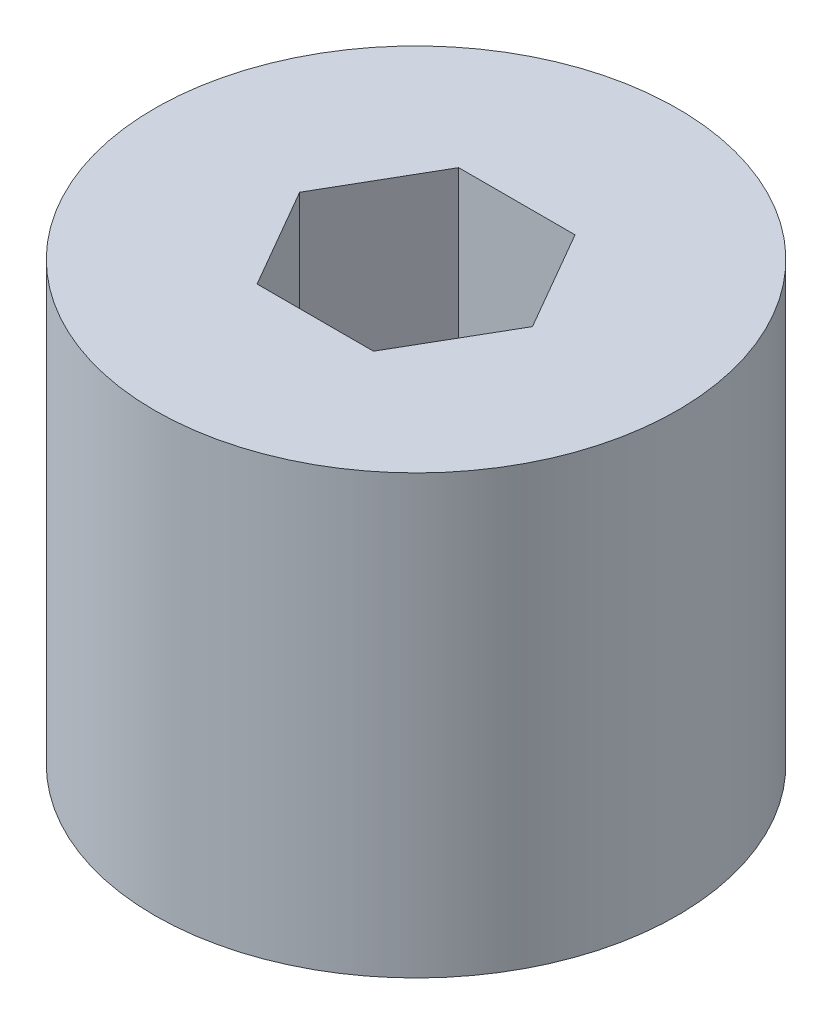
ISO-10303-21;
HEADER;
FILE_DESCRIPTION(('STEP AP214'),'2;1');
FILE_NAME('part.step','',(''),(''),'','','');
FILE_SCHEMA(('AUTOMOTIVE_DESIGN { 1 0 10303 214 1 1 1 1 }'));
ENDSEC;
DATA;
#1=APPLICATION_CONTEXT('core data for automotive mechanical design processes');
#2=APPLICATION_PROTOCOL_DEFINITION('international standard','automotive_design',2000,#1);
#3=PRODUCT_CONTEXT('',#1,'mechanical');
#4=PRODUCT('Part','Part','',(#3));
#5=PRODUCT_RELATED_PRODUCT_CATEGORY('part','',(#4));
#6=PRODUCT_DEFINITION_FORMATION('','',#4);
#7=PRODUCT_DEFINITION_CONTEXT('part definition',#1,'design');
#8=PRODUCT_DEFINITION('design','',#6,#7);
#9=PRODUCT_DEFINITION_SHAPE('','',#8);
#10=(LENGTH_UNIT() NAMED_UNIT(*) SI_UNIT(.MILLI.,.METRE.));
#11=(NAMED_UNIT(*) PLANE_ANGLE_UNIT() SI_UNIT($,.RADIAN.));
#12=(NAMED_UNIT(*) SI_UNIT($,.STERADIAN.) SOLID_ANGLE_UNIT());
#13=UNCERTAINTY_MEASURE_WITH_UNIT(LENGTH_MEASURE(1.E-05),#10,'distance_accuracy_value','');
#14=(GEOMETRIC_REPRESENTATION_CONTEXT(3) GLOBAL_UNCERTAINTY_ASSIGNED_CONTEXT((#13)) GLOBAL_UNIT_ASSIGNED_CONTEXT((#10,
#11,#12)) REPRESENTATION_CONTEXT('',''));
#15=CARTESIAN_POINT('',(0.,0.,0.));
#16=DIRECTION('',(0.,0.,1.));
#17=DIRECTION('',(1.,0.,0.));
#18=AXIS2_PLACEMENT_3D('',#15,#16,#17);
#19=CARTESIAN_POINT('',(0.,29.21,0.));
#20=DIRECTION('',(0.,1.,0.));
#21=DIRECTION('',(0.,0.,1.));
#22=AXIS2_PLACEMENT_3D('',#19,#20,#21);
#23=PLANE('',#22);
#24=CARTESIAN_POINT('',(0.,29.21,0.));
#25=DIRECTION('',(0.,1.,0.));
#26=DIRECTION('',(0.,0.,1.));
#27=AXIS2_PLACEMENT_3D('',#24,#25,#26);
#28=CIRCLE('',#27,17.4625);
#29=CARTESIAN_POINT('',(0.,29.21,17.4625));
#30=VERTEX_POINT('',#29);
#31=EDGE_CURVE('E11',#30,#30,#28,.T.);
#32=ORIENTED_EDGE('',*,*,#31,.T.);
#33=EDGE_LOOP('',(#32));
#34=FACE_BOUND('',#33,.T.);
#35=DIRECTION('',(-0.5,0.,-0.866025403784439));
#36=VECTOR('',#35,1.);
#37=CARTESIAN_POINT('',(7.77228932383075,29.21,0.));
#38=LINE('',#37,#36);
#39=CARTESIAN_POINT('',(7.77228932383075,29.21,0.));
#40=VERTEX_POINT('',#39);
#41=CARTESIAN_POINT('',(3.88614466191537,29.21,-6.73100000000001));
#42=VERTEX_POINT('',#41);
#43=EDGE_CURVE('E94',#40,#42,#38,.T.);
#44=ORIENTED_EDGE('',*,*,#43,.F.);
#45=DIRECTION('',(0.5,0.,-0.866025403784439));
#46=VECTOR('',#45,1.);
#47=CARTESIAN_POINT('',(3.88614466191537,29.21,6.731));
#48=LINE('',#47,#46);
#49=CARTESIAN_POINT('',(3.88614466191537,29.21,6.731));
#50=VERTEX_POINT('',#49);
#51=EDGE_CURVE('E86',#50,#40,#48,.T.);
#52=ORIENTED_EDGE('',*,*,#51,.F.);
#53=DIRECTION('',(1.,0.,0.));
#54=VECTOR('',#53,1.);
#55=CARTESIAN_POINT('',(-3.88614466191537,29.21,6.73100000000001));
#56=LINE('',#55,#54);
#57=CARTESIAN_POINT('',(-3.88614466191537,29.21,6.73100000000001));
#58=VERTEX_POINT('',#57);
#59=EDGE_CURVE('E114',#58,#50,#56,.T.);
#60=ORIENTED_EDGE('',*,*,#59,.F.);
#61=DIRECTION('',(0.5,0.,0.866025403784439));
#62=VECTOR('',#61,1.);
#63=CARTESIAN_POINT('',(-7.77228932383075,29.21,0.));
#64=LINE('',#63,#62);
#65=CARTESIAN_POINT('',(-7.77228932383075,29.21,0.));
#66=VERTEX_POINT('',#65);
#67=EDGE_CURVE('E112',#66,#58,#64,.T.);
#68=ORIENTED_EDGE('',*,*,#67,.F.);
#69=DIRECTION('',(-0.5,0.,0.866025403784439));
#70=VECTOR('',#69,1.);
#71=CARTESIAN_POINT('',(-3.88614466191537,29.21,-6.731));
#72=LINE('',#71,#70);
#73=CARTESIAN_POINT('',(-3.88614466191537,29.21,-6.731));
#74=VERTEX_POINT('',#73);
#75=EDGE_CURVE('E108',#74,#66,#72,.T.);
#76=ORIENTED_EDGE('',*,*,#75,.F.);
#77=DIRECTION('',(-1.,0.,0.));
#78=VECTOR('',#77,1.);
#79=CARTESIAN_POINT('',(3.88614466191537,29.21,-6.73100000000001));
#80=LINE('',#79,#78);
#81=EDGE_CURVE('E106',#42,#74,#80,.T.);
#82=ORIENTED_EDGE('',*,*,#81,.F.);
#83=EDGE_LOOP('',(#44,#52,#60,#68,#76,#82));
#84=FACE_BOUND('',#83,.T.);
#85=ADVANCED_FACE('F33',(#34,#84),#23,.T.);
#86=CARTESIAN_POINT('',(0.,0.,0.));
#87=DIRECTION('',(0.,1.,0.));
#88=DIRECTION('',(0.,0.,1.));
#89=AXIS2_PLACEMENT_3D('',#86,#87,#88);
#90=PLANE('',#89);
#91=CARTESIAN_POINT('',(0.,0.,0.));
#92=DIRECTION('',(0.,1.,0.));
#93=DIRECTION('',(0.,0.,1.));
#94=AXIS2_PLACEMENT_3D('',#91,#92,#93);
#95=CIRCLE('',#94,17.4625);
#96=CARTESIAN_POINT('',(0.,0.,17.4625));
#97=VERTEX_POINT('',#96);
#98=EDGE_CURVE('E37',#97,#97,#95,.T.);
#99=ORIENTED_EDGE('',*,*,#98,.F.);
#100=EDGE_LOOP('',(#99));
#101=FACE_BOUND('',#100,.T.);
#102=DIRECTION('',(0.5,0.,-0.866025403784439));
#103=VECTOR('',#102,1.);
#104=CARTESIAN_POINT('',(3.88614466191537,0.,6.731));
#105=LINE('',#104,#103);
#106=CARTESIAN_POINT('',(3.88614466191537,0.,6.731));
#107=VERTEX_POINT('',#106);
#108=CARTESIAN_POINT('',(7.77228932383075,0.,0.));
#109=VERTEX_POINT('',#108);
#110=EDGE_CURVE('E56',#107,#109,#105,.T.);
#111=ORIENTED_EDGE('',*,*,#110,.T.);
#112=DIRECTION('',(-0.5,0.,-0.866025403784439));
#113=VECTOR('',#112,1.);
#114=CARTESIAN_POINT('',(7.77228932383075,0.,0.));
#115=LINE('',#114,#113);
#116=CARTESIAN_POINT('',(3.88614466191537,0.,-6.73100000000001));
#117=VERTEX_POINT('',#116);
#118=EDGE_CURVE('E101',#109,#117,#115,.T.);
#119=ORIENTED_EDGE('',*,*,#118,.T.);
#120=DIRECTION('',(-1.,0.,0.));
#121=VECTOR('',#120,1.);
#122=CARTESIAN_POINT('',(3.88614466191537,0.,-6.73100000000001));
#123=LINE('',#122,#121);
#124=CARTESIAN_POINT('',(-3.88614466191537,0.,-6.731));
#125=VERTEX_POINT('',#124);
#126=EDGE_CURVE('E118',#117,#125,#123,.T.);
#127=ORIENTED_EDGE('',*,*,#126,.T.);
#128=DIRECTION('',(-0.5,0.,0.866025403784439));
#129=VECTOR('',#128,1.);
#130=CARTESIAN_POINT('',(-3.88614466191537,0.,-6.731));
#131=LINE('',#130,#129);
#132=CARTESIAN_POINT('',(-7.77228932383075,0.,0.));
#133=VERTEX_POINT('',#132);
#134=EDGE_CURVE('E121',#125,#133,#131,.T.);
#135=ORIENTED_EDGE('',*,*,#134,.T.);
#136=DIRECTION('',(0.5,0.,0.866025403784439));
#137=VECTOR('',#136,1.);
#138=CARTESIAN_POINT('',(-7.77228932383075,0.,0.));
#139=LINE('',#138,#137);
#140=CARTESIAN_POINT('',(-3.88614466191537,0.,6.73100000000001));
#141=VERTEX_POINT('',#140);
#142=EDGE_CURVE('E124',#133,#141,#139,.T.);
#143=ORIENTED_EDGE('',*,*,#142,.T.);
#144=DIRECTION('',(1.,0.,0.));
#145=VECTOR('',#144,1.);
#146=CARTESIAN_POINT('',(-3.88614466191537,0.,6.73100000000001));
#147=LINE('',#146,#145);
#148=EDGE_CURVE('E95',#141,#107,#147,.T.);
#149=ORIENTED_EDGE('',*,*,#148,.T.);
#150=EDGE_LOOP('',(#111,#119,#127,#135,#143,#149));
#151=FACE_BOUND('',#150,.T.);
#152=ADVANCED_FACE('F141',(#101,#151),#90,.F.);
#153=CARTESIAN_POINT('',(0.,29.21,0.));
#154=DIRECTION('',(0.,-1.,0.));
#155=DIRECTION('',(0.,0.,-1.));
#156=AXIS2_PLACEMENT_3D('',#153,#154,#155);
#157=CYLINDRICAL_SURFACE('',#156,17.4625);
#158=ORIENTED_EDGE('',*,*,#31,.F.);
#159=EDGE_LOOP('',(#158));
#160=FACE_BOUND('',#159,.T.);
#161=ORIENTED_EDGE('',*,*,#98,.T.);
#162=EDGE_LOOP('',(#161));
#163=FACE_BOUND('',#162,.T.);
#164=ADVANCED_FACE('F35',(#160,#163),#157,.T.);
#165=CARTESIAN_POINT('',(3.88614466191537,29.21,6.731));
#166=DIRECTION('',(-0.866025403784439,0.,-0.5));
#167=DIRECTION('',(-0.5,0.,0.866025403784439));
#168=AXIS2_PLACEMENT_3D('',#165,#166,#167);
#169=PLANE('',#168);
#170=ORIENTED_EDGE('',*,*,#110,.F.);
#171=DIRECTION('',(0.,-1.,0.));
#172=VECTOR('',#171,1.);
#173=CARTESIAN_POINT('',(3.88614466191537,29.21,6.731));
#174=LINE('',#173,#172);
#175=EDGE_CURVE('E90',#50,#107,#174,.T.);
#176=ORIENTED_EDGE('',*,*,#175,.F.);
#177=ORIENTED_EDGE('',*,*,#51,.T.);
#178=DIRECTION('',(0.,-1.,0.));
#179=VECTOR('',#178,1.);
#180=CARTESIAN_POINT('',(7.77228932383075,29.21,0.));
#181=LINE('',#180,#179);
#182=EDGE_CURVE('E89',#40,#109,#181,.T.);
#183=ORIENTED_EDGE('',*,*,#182,.T.);
#184=EDGE_LOOP('',(#170,#176,#177,#183));
#185=FACE_BOUND('',#184,.T.);
#186=ADVANCED_FACE('F88',(#185),#169,.T.);
#187=CARTESIAN_POINT('',(7.77228932383075,29.21,0.));
#188=DIRECTION('',(-0.866025403784439,0.,0.5));
#189=DIRECTION('',(0.5,0.,0.866025403784439));
#190=AXIS2_PLACEMENT_3D('',#187,#188,#189);
#191=PLANE('',#190);
#192=ORIENTED_EDGE('',*,*,#118,.F.);
#193=ORIENTED_EDGE('',*,*,#182,.F.);
#194=ORIENTED_EDGE('',*,*,#43,.T.);
#195=DIRECTION('',(0.,-1.,0.));
#196=VECTOR('',#195,1.);
#197=CARTESIAN_POINT('',(3.88614466191537,29.21,-6.73100000000001));
#198=LINE('',#197,#196);
#199=EDGE_CURVE('E102',#42,#117,#198,.T.);
#200=ORIENTED_EDGE('',*,*,#199,.T.);
#201=EDGE_LOOP('',(#192,#193,#194,#200));
#202=FACE_BOUND('',#201,.T.);
#203=ADVANCED_FACE('F98',(#202),#191,.T.);
#204=CARTESIAN_POINT('',(3.88614466191537,29.21,-6.73100000000001));
#205=DIRECTION('',(0.,0.,1.));
#206=DIRECTION('',(1.,0.,0.));
#207=AXIS2_PLACEMENT_3D('',#204,#205,#206);
#208=PLANE('',#207);
#209=ORIENTED_EDGE('',*,*,#126,.F.);
#210=ORIENTED_EDGE('',*,*,#199,.F.);
#211=ORIENTED_EDGE('',*,*,#81,.T.);
#212=DIRECTION('',(0.,-1.,0.));
#213=VECTOR('',#212,1.);
#214=CARTESIAN_POINT('',(-3.88614466191537,29.21,-6.731));
#215=LINE('',#214,#213);
#216=EDGE_CURVE('E133',#74,#125,#215,.T.);
#217=ORIENTED_EDGE('',*,*,#216,.T.);
#218=EDGE_LOOP('',(#209,#210,#211,#217));
#219=FACE_BOUND('',#218,.T.);
#220=ADVANCED_FACE('F137',(#219),#208,.T.);
#221=CARTESIAN_POINT('',(-3.88614466191537,29.21,-6.731));
#222=DIRECTION('',(0.866025403784439,0.,0.5));
#223=DIRECTION('',(0.5,0.,-0.866025403784439));
#224=AXIS2_PLACEMENT_3D('',#221,#222,#223);
#225=PLANE('',#224);
#226=ORIENTED_EDGE('',*,*,#134,.F.);
#227=ORIENTED_EDGE('',*,*,#216,.F.);
#228=ORIENTED_EDGE('',*,*,#75,.T.);
#229=DIRECTION('',(0.,-1.,0.));
#230=VECTOR('',#229,1.);
#231=CARTESIAN_POINT('',(-7.77228932383075,29.21,0.));
#232=LINE('',#231,#230);
#233=EDGE_CURVE('E131',#66,#133,#232,.T.);
#234=ORIENTED_EDGE('',*,*,#233,.T.);
#235=EDGE_LOOP('',(#226,#227,#228,#234));
#236=FACE_BOUND('',#235,.T.);
#237=ADVANCED_FACE('F149',(#236),#225,.T.);
#238=CARTESIAN_POINT('',(-7.77228932383075,29.21,0.));
#239=DIRECTION('',(0.866025403784439,0.,-0.5));
#240=DIRECTION('',(-0.5,0.,-0.866025403784439));
#241=AXIS2_PLACEMENT_3D('',#238,#239,#240);
#242=PLANE('',#241);
#243=ORIENTED_EDGE('',*,*,#142,.F.);
#244=ORIENTED_EDGE('',*,*,#233,.F.);
#245=ORIENTED_EDGE('',*,*,#67,.T.);
#246=DIRECTION('',(0.,-1.,0.));
#247=VECTOR('',#246,1.);
#248=CARTESIAN_POINT('',(-3.88614466191537,29.21,6.73100000000001));
#249=LINE('',#248,#247);
#250=EDGE_CURVE('E48',#58,#141,#249,.T.);
#251=ORIENTED_EDGE('',*,*,#250,.T.);
#252=EDGE_LOOP('',(#243,#244,#245,#251));
#253=FACE_BOUND('',#252,.T.);
#254=ADVANCED_FACE('F147',(#253),#242,.T.);
#255=CARTESIAN_POINT('',(-3.88614466191537,29.21,6.73100000000001));
#256=DIRECTION('',(0.,0.,-1.));
#257=DIRECTION('',(-1.,0.,0.));
#258=AXIS2_PLACEMENT_3D('',#255,#256,#257);
#259=PLANE('',#258);
#260=ORIENTED_EDGE('',*,*,#148,.F.);
#261=ORIENTED_EDGE('',*,*,#250,.F.);
#262=ORIENTED_EDGE('',*,*,#59,.T.);
#263=ORIENTED_EDGE('',*,*,#175,.T.);
#264=EDGE_LOOP('',(#260,#261,#262,#263));
#265=FACE_BOUND('',#264,.T.);
#266=ADVANCED_FACE('F143',(#265),#259,.T.);
#267=CLOSED_SHELL('',(#85,#152,#164,#186,#203,#220,#237,#254,#266));
#268=MANIFOLD_SOLID_BREP('B2',#267);
#269=ADVANCED_BREP_SHAPE_REPRESENTATION('',(#18,#268),#14);
#270=SHAPE_DEFINITION_REPRESENTATION(#9,#269);
ENDSEC;
END-ISO-10303-21;
